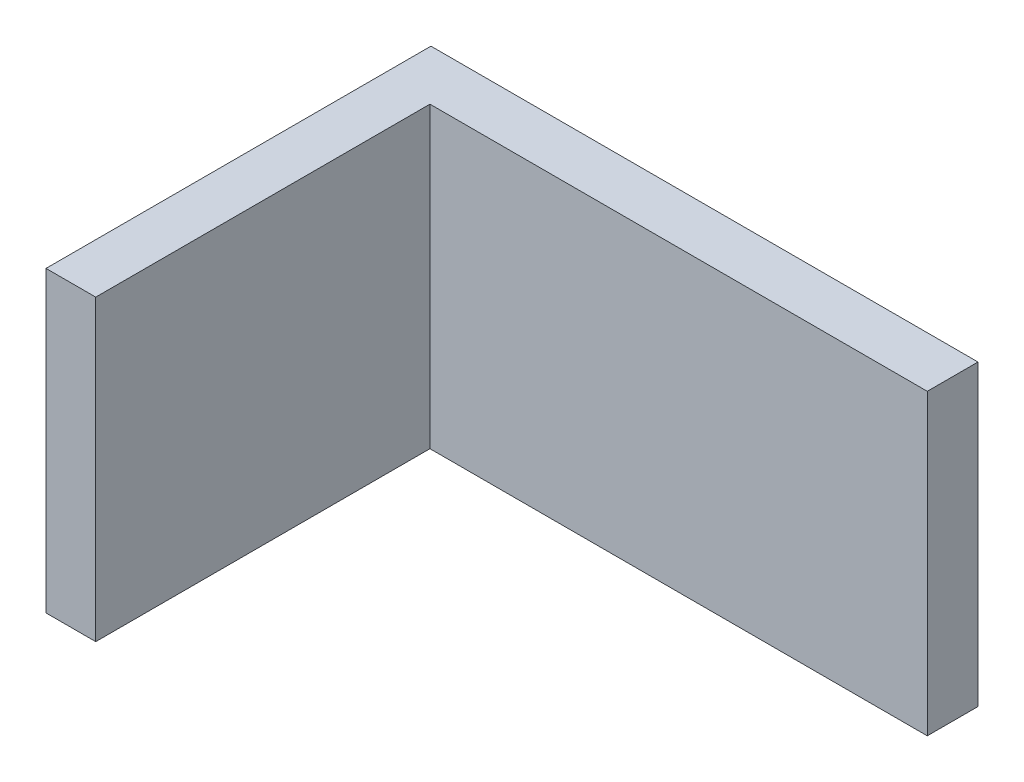
ISO-10303-21;
HEADER;
FILE_DESCRIPTION(('STEP AP214'),'2;1');
FILE_NAME('part.step','',(''),(''),'','','');
FILE_SCHEMA(('AUTOMOTIVE_DESIGN { 1 0 10303 214 1 1 1 1 }'));
ENDSEC;
DATA;
#1=APPLICATION_CONTEXT('core data for automotive mechanical design processes');
#2=APPLICATION_PROTOCOL_DEFINITION('international standard','automotive_design',2000,#1);
#3=PRODUCT_CONTEXT('',#1,'mechanical');
#4=PRODUCT('Part','Part','',(#3));
#5=PRODUCT_RELATED_PRODUCT_CATEGORY('part','',(#4));
#6=PRODUCT_DEFINITION_FORMATION('','',#4);
#7=PRODUCT_DEFINITION_CONTEXT('part definition',#1,'design');
#8=PRODUCT_DEFINITION('design','',#6,#7);
#9=PRODUCT_DEFINITION_SHAPE('','',#8);
#10=(LENGTH_UNIT() NAMED_UNIT(*) SI_UNIT(.MILLI.,.METRE.));
#11=(NAMED_UNIT(*) PLANE_ANGLE_UNIT() SI_UNIT($,.RADIAN.));
#12=(NAMED_UNIT(*) SI_UNIT($,.STERADIAN.) SOLID_ANGLE_UNIT());
#13=UNCERTAINTY_MEASURE_WITH_UNIT(LENGTH_MEASURE(1.E-05),#10,'distance_accuracy_value','');
#14=(GEOMETRIC_REPRESENTATION_CONTEXT(3) GLOBAL_UNCERTAINTY_ASSIGNED_CONTEXT((#13)) GLOBAL_UNIT_ASSIGNED_CONTEXT((#10,
#11,#12)) REPRESENTATION_CONTEXT('',''));
#15=CARTESIAN_POINT('',(0.,0.,0.));
#16=DIRECTION('',(0.,0.,1.));
#17=DIRECTION('',(1.,0.,0.));
#18=AXIS2_PLACEMENT_3D('',#15,#16,#17);
#19=CARTESIAN_POINT('',(-4.55,-3.4,0.));
#20=DIRECTION('',(0.,-1.,0.));
#21=DIRECTION('',(0.,0.,1.));
#22=AXIS2_PLACEMENT_3D('',#19,#20,#21);
#23=PLANE('',#22);
#24=DIRECTION('',(-1.,0.,0.));
#25=VECTOR('',#24,1.);
#26=CARTESIAN_POINT('',(-4.,-3.4,0.));
#27=LINE('',#26,#25);
#28=CARTESIAN_POINT('',(-4.,-3.4,0.));
#29=VERTEX_POINT('',#28);
#30=CARTESIAN_POINT('',(-4.55,-3.4,0.));
#31=VERTEX_POINT('',#30);
#32=EDGE_CURVE('E11',#29,#31,#27,.T.);
#33=ORIENTED_EDGE('',*,*,#32,.F.);
#34=DIRECTION('',(0.,0.,-1.));
#35=VECTOR('',#34,1.);
#36=CARTESIAN_POINT('',(-4.,-3.4,0.051));
#37=LINE('',#36,#35);
#38=CARTESIAN_POINT('',(-4.,-3.4,0.051));
#39=VERTEX_POINT('',#38);
#40=EDGE_CURVE('E24',#39,#29,#37,.T.);
#41=ORIENTED_EDGE('',*,*,#40,.F.);
#42=DIRECTION('',(1.,0.,0.));
#43=VECTOR('',#42,1.);
#44=CARTESIAN_POINT('',(-4.5,-3.4,0.051));
#45=LINE('',#44,#43);
#46=CARTESIAN_POINT('',(-4.5,-3.4,0.051));
#47=VERTEX_POINT('',#46);
#48=EDGE_CURVE('E87',#47,#39,#45,.T.);
#49=ORIENTED_EDGE('',*,*,#48,.F.);
#50=DIRECTION('',(0.,0.,-1.));
#51=VECTOR('',#50,1.);
#52=CARTESIAN_POINT('',(-4.5,-3.4,0.387));
#53=LINE('',#52,#51);
#54=CARTESIAN_POINT('',(-4.5,-3.4,0.387));
#55=VERTEX_POINT('',#54);
#56=EDGE_CURVE('E114',#55,#47,#53,.T.);
#57=ORIENTED_EDGE('',*,*,#56,.F.);
#58=DIRECTION('',(1.,0.,0.));
#59=VECTOR('',#58,1.);
#60=CARTESIAN_POINT('',(-4.55,-3.4,0.387));
#61=LINE('',#60,#59);
#62=CARTESIAN_POINT('',(-4.55,-3.4,0.387));
#63=VERTEX_POINT('',#62);
#64=EDGE_CURVE('E111',#63,#55,#61,.T.);
#65=ORIENTED_EDGE('',*,*,#64,.F.);
#66=DIRECTION('',(0.,0.,1.));
#67=VECTOR('',#66,1.);
#68=CARTESIAN_POINT('',(-4.55,-3.4,0.));
#69=LINE('',#68,#67);
#70=EDGE_CURVE('E108',#31,#63,#69,.T.);
#71=ORIENTED_EDGE('',*,*,#70,.F.);
#72=EDGE_LOOP('',(#33,#41,#49,#57,#65,#71));
#73=FACE_BOUND('',#72,.T.);
#74=ADVANCED_FACE('F17',(#73),#23,.T.);
#75=CARTESIAN_POINT('',(-4.,-3.1,0.));
#76=DIRECTION('',(0.,1.,0.));
#77=DIRECTION('',(0.,0.,1.));
#78=AXIS2_PLACEMENT_3D('',#75,#76,#77);
#79=PLANE('',#78);
#80=DIRECTION('',(1.,0.,0.));
#81=VECTOR('',#80,1.);
#82=CARTESIAN_POINT('',(-4.55,-3.1,0.));
#83=LINE('',#82,#81);
#84=CARTESIAN_POINT('',(-4.55,-3.1,0.));
#85=VERTEX_POINT('',#84);
#86=CARTESIAN_POINT('',(-4.,-3.1,0.));
#87=VERTEX_POINT('',#86);
#88=EDGE_CURVE('E106',#85,#87,#83,.T.);
#89=ORIENTED_EDGE('',*,*,#88,.F.);
#90=DIRECTION('',(0.,0.,-1.));
#91=VECTOR('',#90,1.);
#92=CARTESIAN_POINT('',(-4.55,-3.1,0.387));
#93=LINE('',#92,#91);
#94=CARTESIAN_POINT('',(-4.55,-3.1,0.387));
#95=VERTEX_POINT('',#94);
#96=EDGE_CURVE('E103',#95,#85,#93,.T.);
#97=ORIENTED_EDGE('',*,*,#96,.F.);
#98=DIRECTION('',(-1.,0.,0.));
#99=VECTOR('',#98,1.);
#100=CARTESIAN_POINT('',(-4.5,-3.1,0.387));
#101=LINE('',#100,#99);
#102=CARTESIAN_POINT('',(-4.5,-3.1,0.387));
#103=VERTEX_POINT('',#102);
#104=EDGE_CURVE('E100',#103,#95,#101,.T.);
#105=ORIENTED_EDGE('',*,*,#104,.F.);
#106=DIRECTION('',(0.,0.,1.));
#107=VECTOR('',#106,1.);
#108=CARTESIAN_POINT('',(-4.5,-3.1,0.051));
#109=LINE('',#108,#107);
#110=CARTESIAN_POINT('',(-4.5,-3.1,0.051));
#111=VERTEX_POINT('',#110);
#112=EDGE_CURVE('E72',#111,#103,#109,.T.);
#113=ORIENTED_EDGE('',*,*,#112,.F.);
#114=DIRECTION('',(-1.,0.,0.));
#115=VECTOR('',#114,1.);
#116=CARTESIAN_POINT('',(-4.,-3.1,0.051));
#117=LINE('',#116,#115);
#118=CARTESIAN_POINT('',(-4.,-3.1,0.051));
#119=VERTEX_POINT('',#118);
#120=EDGE_CURVE('E66',#119,#111,#117,.T.);
#121=ORIENTED_EDGE('',*,*,#120,.F.);
#122=DIRECTION('',(0.,0.,1.));
#123=VECTOR('',#122,1.);
#124=CARTESIAN_POINT('',(-4.,-3.1,0.));
#125=LINE('',#124,#123);
#126=EDGE_CURVE('E69',#87,#119,#125,.T.);
#127=ORIENTED_EDGE('',*,*,#126,.F.);
#128=EDGE_LOOP('',(#89,#97,#105,#113,#121,#127));
#129=FACE_BOUND('',#128,.T.);
#130=ADVANCED_FACE('F68',(#129),#79,.T.);
#131=CARTESIAN_POINT('',(-4.55,-3.4,0.387));
#132=DIRECTION('',(0.,0.,1.));
#133=DIRECTION('',(0.,1.,0.));
#134=AXIS2_PLACEMENT_3D('',#131,#132,#133);
#135=PLANE('',#134);
#136=ORIENTED_EDGE('',*,*,#64,.T.);
#137=DIRECTION('',(0.,-1.,0.));
#138=VECTOR('',#137,1.);
#139=CARTESIAN_POINT('',(-4.5,-3.1,0.387));
#140=LINE('',#139,#138);
#141=EDGE_CURVE('E83',#103,#55,#140,.T.);
#142=ORIENTED_EDGE('',*,*,#141,.F.);
#143=ORIENTED_EDGE('',*,*,#104,.T.);
#144=DIRECTION('',(0.,1.,0.));
#145=VECTOR('',#144,1.);
#146=CARTESIAN_POINT('',(-4.55,-3.4,0.387));
#147=LINE('',#146,#145);
#148=EDGE_CURVE('E88',#63,#95,#147,.T.);
#149=ORIENTED_EDGE('',*,*,#148,.F.);
#150=EDGE_LOOP('',(#136,#142,#143,#149));
#151=FACE_BOUND('',#150,.T.);
#152=ADVANCED_FACE('F125',(#151),#135,.T.);
#153=CARTESIAN_POINT('',(-4.5,-3.4,0.051));
#154=DIRECTION('',(0.,0.,1.));
#155=DIRECTION('',(0.,1.,0.));
#156=AXIS2_PLACEMENT_3D('',#153,#154,#155);
#157=PLANE('',#156);
#158=ORIENTED_EDGE('',*,*,#48,.T.);
#159=DIRECTION('',(0.,-1.,0.));
#160=VECTOR('',#159,1.);
#161=CARTESIAN_POINT('',(-4.,-3.1,0.051));
#162=LINE('',#161,#160);
#163=EDGE_CURVE('E81',#119,#39,#162,.T.);
#164=ORIENTED_EDGE('',*,*,#163,.F.);
#165=ORIENTED_EDGE('',*,*,#120,.T.);
#166=DIRECTION('',(0.,1.,0.));
#167=VECTOR('',#166,1.);
#168=CARTESIAN_POINT('',(-4.5,-3.4,0.051));
#169=LINE('',#168,#167);
#170=EDGE_CURVE('E89',#47,#111,#169,.T.);
#171=ORIENTED_EDGE('',*,*,#170,.F.);
#172=EDGE_LOOP('',(#158,#164,#165,#171));
#173=FACE_BOUND('',#172,.T.);
#174=ADVANCED_FACE('F86',(#173),#157,.T.);
#175=CARTESIAN_POINT('',(-4.55,-3.1,0.));
#176=DIRECTION('',(-1.,0.,0.));
#177=DIRECTION('',(0.,0.,1.));
#178=AXIS2_PLACEMENT_3D('',#175,#176,#177);
#179=PLANE('',#178);
#180=DIRECTION('',(0.,1.,0.));
#181=VECTOR('',#180,1.);
#182=CARTESIAN_POINT('',(-4.55,-3.4,0.));
#183=LINE('',#182,#181);
#184=EDGE_CURVE('E93',#31,#85,#183,.T.);
#185=ORIENTED_EDGE('',*,*,#184,.F.);
#186=ORIENTED_EDGE('',*,*,#70,.T.);
#187=ORIENTED_EDGE('',*,*,#148,.T.);
#188=ORIENTED_EDGE('',*,*,#96,.T.);
#189=EDGE_LOOP('',(#185,#186,#187,#188));
#190=FACE_BOUND('',#189,.T.);
#191=ADVANCED_FACE('F121',(#190),#179,.T.);
#192=CARTESIAN_POINT('',(-4.,-3.4,0.));
#193=DIRECTION('',(1.,0.,0.));
#194=DIRECTION('',(0.,0.,1.));
#195=AXIS2_PLACEMENT_3D('',#192,#193,#194);
#196=PLANE('',#195);
#197=DIRECTION('',(0.,-1.,0.));
#198=VECTOR('',#197,1.);
#199=CARTESIAN_POINT('',(-4.,-3.1,0.));
#200=LINE('',#199,#198);
#201=EDGE_CURVE('E82',#87,#29,#200,.T.);
#202=ORIENTED_EDGE('',*,*,#201,.F.);
#203=ORIENTED_EDGE('',*,*,#126,.T.);
#204=ORIENTED_EDGE('',*,*,#163,.T.);
#205=ORIENTED_EDGE('',*,*,#40,.T.);
#206=EDGE_LOOP('',(#202,#203,#204,#205));
#207=FACE_BOUND('',#206,.T.);
#208=ADVANCED_FACE('F80',(#207),#196,.T.);
#209=CARTESIAN_POINT('',(-4.5,-3.4,0.051));
#210=DIRECTION('',(1.,0.,0.));
#211=DIRECTION('',(0.,0.,1.));
#212=AXIS2_PLACEMENT_3D('',#209,#210,#211);
#213=PLANE('',#212);
#214=ORIENTED_EDGE('',*,*,#170,.T.);
#215=ORIENTED_EDGE('',*,*,#112,.T.);
#216=ORIENTED_EDGE('',*,*,#141,.T.);
#217=ORIENTED_EDGE('',*,*,#56,.T.);
#218=EDGE_LOOP('',(#214,#215,#216,#217));
#219=FACE_BOUND('',#218,.T.);
#220=ADVANCED_FACE('F127',(#219),#213,.T.);
#221=CARTESIAN_POINT('',(-4.55,-3.1,0.));
#222=DIRECTION('',(0.,0.,-1.));
#223=DIRECTION('',(0.,1.,0.));
#224=AXIS2_PLACEMENT_3D('',#221,#222,#223);
#225=PLANE('',#224);
#226=ORIENTED_EDGE('',*,*,#88,.T.);
#227=ORIENTED_EDGE('',*,*,#201,.T.);
#228=ORIENTED_EDGE('',*,*,#32,.T.);
#229=ORIENTED_EDGE('',*,*,#184,.T.);
#230=EDGE_LOOP('',(#226,#227,#228,#229));
#231=FACE_BOUND('',#230,.T.);
#232=ADVANCED_FACE('F117',(#231),#225,.T.);
#233=CLOSED_SHELL('',(#74,#130,#152,#174,#191,#208,#220,#232));
#234=MANIFOLD_SOLID_BREP('B1',#233);
#235=ADVANCED_BREP_SHAPE_REPRESENTATION('',(#18,#234),#14);
#236=SHAPE_DEFINITION_REPRESENTATION(#9,#235);
ENDSEC;
END-ISO-10303-21;
